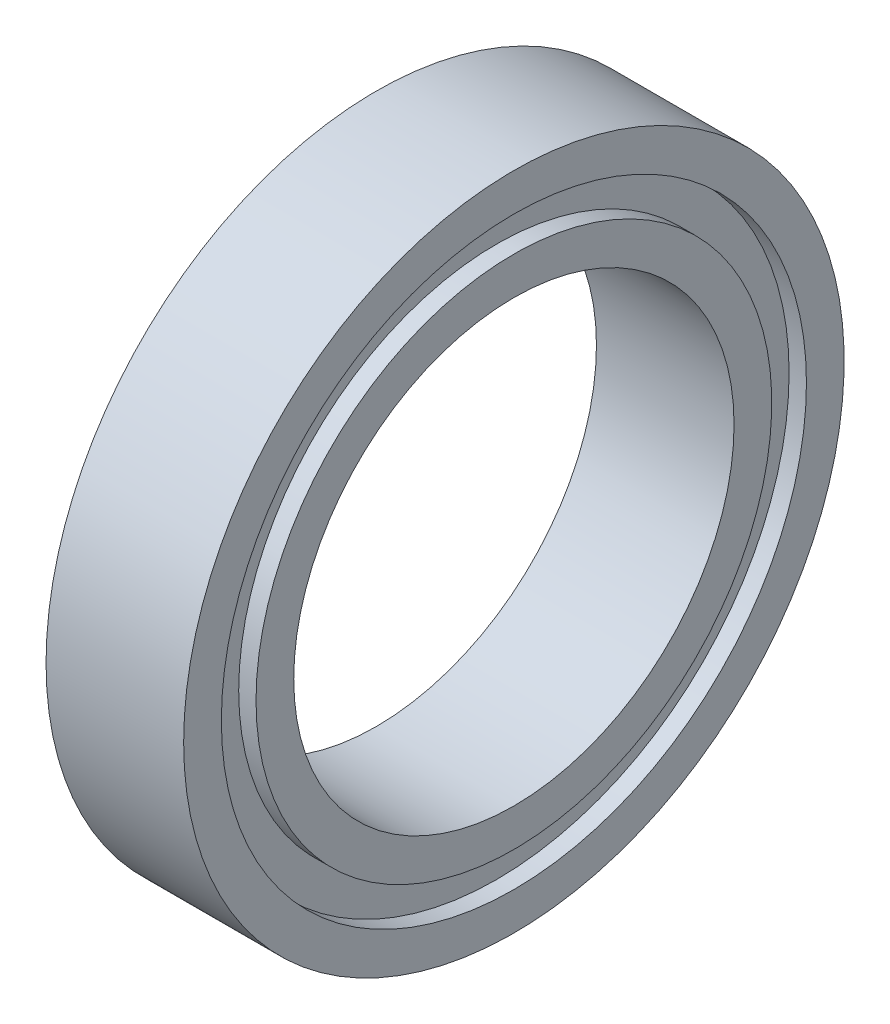
ISO-10303-21;
HEADER;
FILE_DESCRIPTION(('STEP AP214'),'2;1');
FILE_NAME('part.step','',(''),(''),'','','');
FILE_SCHEMA(('AUTOMOTIVE_DESIGN { 1 0 10303 214 1 1 1 1 }'));
ENDSEC;
DATA;
#1=APPLICATION_CONTEXT('core data for automotive mechanical design processes');
#2=APPLICATION_PROTOCOL_DEFINITION('international standard','automotive_design',2000,#1);
#3=PRODUCT_CONTEXT('',#1,'mechanical');
#4=PRODUCT('Part','Part','',(#3));
#5=PRODUCT_RELATED_PRODUCT_CATEGORY('part','',(#4));
#6=PRODUCT_DEFINITION_FORMATION('','',#4);
#7=PRODUCT_DEFINITION_CONTEXT('part definition',#1,'design');
#8=PRODUCT_DEFINITION('design','',#6,#7);
#9=PRODUCT_DEFINITION_SHAPE('','',#8);
#10=(LENGTH_UNIT() NAMED_UNIT(*) SI_UNIT(.MILLI.,.METRE.));
#11=(NAMED_UNIT(*) PLANE_ANGLE_UNIT() SI_UNIT($,.RADIAN.));
#12=(NAMED_UNIT(*) SI_UNIT($,.STERADIAN.) SOLID_ANGLE_UNIT());
#13=UNCERTAINTY_MEASURE_WITH_UNIT(LENGTH_MEASURE(1.E-05),#10,'distance_accuracy_value','');
#14=(GEOMETRIC_REPRESENTATION_CONTEXT(3) GLOBAL_UNCERTAINTY_ASSIGNED_CONTEXT((#13)) GLOBAL_UNIT_ASSIGNED_CONTEXT((#10,
#11,#12)) REPRESENTATION_CONTEXT('',''));
#15=CARTESIAN_POINT('',(0.,0.,0.));
#16=DIRECTION('',(0.,0.,1.));
#17=DIRECTION('',(1.,0.,0.));
#18=AXIS2_PLACEMENT_3D('',#15,#16,#17);
#19=CARTESIAN_POINT('',(-1.984375,9.525,0.));
#20=DIRECTION('',(1.,0.,0.));
#21=DIRECTION('',(0.,0.,-1.));
#22=AXIS2_PLACEMENT_3D('',#19,#20,#21);
#23=PLANE('',#22);
#24=CARTESIAN_POINT('',(-1.984375,0.,0.));
#25=DIRECTION('',(-1.,0.,0.));
#26=DIRECTION('',(0.,0.,1.));
#27=AXIS2_PLACEMENT_3D('',#24,#25,#26);
#28=CIRCLE('',#27,8.4375);
#29=CARTESIAN_POINT('',(-1.984375,0.,8.4375));
#30=VERTEX_POINT('',#29);
#31=EDGE_CURVE('E10',#30,#30,#28,.T.);
#32=ORIENTED_EDGE('',*,*,#31,.F.);
#33=EDGE_LOOP('',(#32));
#34=FACE_BOUND('',#33,.T.);
#35=CARTESIAN_POINT('',(-1.984375,0.,0.));
#36=DIRECTION('',(-1.,0.,0.));
#37=DIRECTION('',(0.,0.,1.));
#38=AXIS2_PLACEMENT_3D('',#35,#36,#37);
#39=CIRCLE('',#38,9.525);
#40=CARTESIAN_POINT('',(-1.984375,0.,9.525));
#41=VERTEX_POINT('',#40);
#42=EDGE_CURVE('E69',#41,#41,#39,.T.);
#43=ORIENTED_EDGE('',*,*,#42,.T.);
#44=EDGE_LOOP('',(#43));
#45=FACE_BOUND('',#44,.T.);
#46=ADVANCED_FACE('F29',(#34,#45),#23,.F.);
#47=CARTESIAN_POINT('',(-6.83914473989944,0.,0.));
#48=DIRECTION('',(-1.,0.,0.));
#49=DIRECTION('',(0.,0.,1.));
#50=AXIS2_PLACEMENT_3D('',#47,#48,#49);
#51=CYLINDRICAL_SURFACE('',#50,8.4375);
#52=CARTESIAN_POINT('',(-1.484375,0.,0.));
#53=DIRECTION('',(-1.,0.,0.));
#54=DIRECTION('',(0.,0.,1.));
#55=AXIS2_PLACEMENT_3D('',#52,#53,#54);
#56=CIRCLE('',#55,8.4375);
#57=CARTESIAN_POINT('',(-1.484375,0.,8.4375));
#58=VERTEX_POINT('',#57);
#59=EDGE_CURVE('E35',#58,#58,#56,.T.);
#60=ORIENTED_EDGE('',*,*,#59,.F.);
#61=EDGE_LOOP('',(#60));
#62=FACE_BOUND('',#61,.T.);
#63=ORIENTED_EDGE('',*,*,#31,.T.);
#64=EDGE_LOOP('',(#63));
#65=FACE_BOUND('',#64,.T.);
#66=ADVANCED_FACE('F130',(#62,#65),#51,.F.);
#67=CARTESIAN_POINT('',(-1.484375,8.4375,0.));
#68=DIRECTION('',(1.,0.,0.));
#69=DIRECTION('',(0.,0.,-1.));
#70=AXIS2_PLACEMENT_3D('',#67,#68,#69);
#71=PLANE('',#70);
#72=CARTESIAN_POINT('',(-1.484375,0.,0.));
#73=DIRECTION('',(-1.,0.,0.));
#74=DIRECTION('',(0.,0.,1.));
#75=AXIS2_PLACEMENT_3D('',#72,#73,#74);
#76=CIRCLE('',#75,7.4375);
#77=CARTESIAN_POINT('',(-1.484375,0.,7.4375));
#78=VERTEX_POINT('',#77);
#79=EDGE_CURVE('E39',#78,#78,#76,.T.);
#80=ORIENTED_EDGE('',*,*,#79,.F.);
#81=EDGE_LOOP('',(#80));
#82=FACE_BOUND('',#81,.T.);
#83=ORIENTED_EDGE('',*,*,#59,.T.);
#84=EDGE_LOOP('',(#83));
#85=FACE_BOUND('',#84,.T.);
#86=ADVANCED_FACE('F125',(#82,#85),#71,.F.);
#87=CARTESIAN_POINT('',(-6.83914473989944,0.,0.));
#88=DIRECTION('',(-1.,0.,0.));
#89=DIRECTION('',(0.,0.,1.));
#90=AXIS2_PLACEMENT_3D('',#87,#88,#89);
#91=CYLINDRICAL_SURFACE('',#90,7.4375);
#92=CARTESIAN_POINT('',(-1.984375,0.,0.));
#93=DIRECTION('',(-1.,0.,0.));
#94=DIRECTION('',(0.,0.,1.));
#95=AXIS2_PLACEMENT_3D('',#92,#93,#94);
#96=CIRCLE('',#95,7.4375);
#97=CARTESIAN_POINT('',(-1.984375,0.,7.4375));
#98=VERTEX_POINT('',#97);
#99=EDGE_CURVE('E43',#98,#98,#96,.T.);
#100=ORIENTED_EDGE('',*,*,#99,.F.);
#101=EDGE_LOOP('',(#100));
#102=FACE_BOUND('',#101,.T.);
#103=ORIENTED_EDGE('',*,*,#79,.T.);
#104=EDGE_LOOP('',(#103));
#105=FACE_BOUND('',#104,.T.);
#106=ADVANCED_FACE('F119',(#102,#105),#91,.T.);
#107=CARTESIAN_POINT('',(-1.984375,7.4375,0.));
#108=DIRECTION('',(1.,0.,0.));
#109=DIRECTION('',(0.,0.,-1.));
#110=AXIS2_PLACEMENT_3D('',#107,#108,#109);
#111=PLANE('',#110);
#112=CARTESIAN_POINT('',(-1.984375,0.,0.));
#113=DIRECTION('',(-1.,0.,0.));
#114=DIRECTION('',(0.,0.,1.));
#115=AXIS2_PLACEMENT_3D('',#112,#113,#114);
#116=CIRCLE('',#115,6.35);
#117=CARTESIAN_POINT('',(-1.984375,0.,6.35));
#118=VERTEX_POINT('',#117);
#119=EDGE_CURVE('E48',#118,#118,#116,.T.);
#120=ORIENTED_EDGE('',*,*,#119,.F.);
#121=EDGE_LOOP('',(#120));
#122=FACE_BOUND('',#121,.T.);
#123=ORIENTED_EDGE('',*,*,#99,.T.);
#124=EDGE_LOOP('',(#123));
#125=FACE_BOUND('',#124,.T.);
#126=ADVANCED_FACE('F113',(#122,#125),#111,.F.);
#127=CARTESIAN_POINT('',(-6.83914473989944,0.,0.));
#128=DIRECTION('',(-1.,0.,0.));
#129=DIRECTION('',(0.,0.,1.));
#130=AXIS2_PLACEMENT_3D('',#127,#128,#129);
#131=CYLINDRICAL_SURFACE('',#130,6.35);
#132=CARTESIAN_POINT('',(1.984375,0.,0.));
#133=DIRECTION('',(-1.,0.,0.));
#134=DIRECTION('',(0.,0.,1.));
#135=AXIS2_PLACEMENT_3D('',#132,#133,#134);
#136=CIRCLE('',#135,6.35);
#137=CARTESIAN_POINT('',(1.984375,0.,6.35));
#138=VERTEX_POINT('',#137);
#139=EDGE_CURVE('E51',#138,#138,#136,.T.);
#140=ORIENTED_EDGE('',*,*,#139,.F.);
#141=EDGE_LOOP('',(#140));
#142=FACE_BOUND('',#141,.T.);
#143=ORIENTED_EDGE('',*,*,#119,.T.);
#144=EDGE_LOOP('',(#143));
#145=FACE_BOUND('',#144,.T.);
#146=ADVANCED_FACE('F107',(#142,#145),#131,.F.);
#147=CARTESIAN_POINT('',(1.984375,7.4375,0.));
#148=DIRECTION('',(-1.,0.,0.));
#149=DIRECTION('',(0.,0.,1.));
#150=AXIS2_PLACEMENT_3D('',#147,#148,#149);
#151=PLANE('',#150);
#152=CARTESIAN_POINT('',(1.984375,0.,0.));
#153=DIRECTION('',(-1.,0.,0.));
#154=DIRECTION('',(0.,0.,1.));
#155=AXIS2_PLACEMENT_3D('',#152,#153,#154);
#156=CIRCLE('',#155,7.4375);
#157=CARTESIAN_POINT('',(1.984375,0.,7.4375));
#158=VERTEX_POINT('',#157);
#159=EDGE_CURVE('E54',#158,#158,#156,.T.);
#160=ORIENTED_EDGE('',*,*,#159,.F.);
#161=EDGE_LOOP('',(#160));
#162=FACE_BOUND('',#161,.T.);
#163=ORIENTED_EDGE('',*,*,#139,.T.);
#164=EDGE_LOOP('',(#163));
#165=FACE_BOUND('',#164,.T.);
#166=ADVANCED_FACE('F101',(#162,#165),#151,.F.);
#167=CARTESIAN_POINT('',(-6.83914473989944,0.,0.));
#168=DIRECTION('',(-1.,0.,0.));
#169=DIRECTION('',(0.,0.,1.));
#170=AXIS2_PLACEMENT_3D('',#167,#168,#169);
#171=CYLINDRICAL_SURFACE('',#170,7.4375);
#172=CARTESIAN_POINT('',(1.484375,0.,0.));
#173=DIRECTION('',(-1.,0.,0.));
#174=DIRECTION('',(0.,0.,1.));
#175=AXIS2_PLACEMENT_3D('',#172,#173,#174);
#176=CIRCLE('',#175,7.4375);
#177=CARTESIAN_POINT('',(1.484375,0.,7.4375));
#178=VERTEX_POINT('',#177);
#179=EDGE_CURVE('E57',#178,#178,#176,.T.);
#180=ORIENTED_EDGE('',*,*,#179,.F.);
#181=EDGE_LOOP('',(#180));
#182=FACE_BOUND('',#181,.T.);
#183=ORIENTED_EDGE('',*,*,#159,.T.);
#184=EDGE_LOOP('',(#183));
#185=FACE_BOUND('',#184,.T.);
#186=ADVANCED_FACE('F95',(#182,#185),#171,.T.);
#187=CARTESIAN_POINT('',(1.484375,8.4375,0.));
#188=DIRECTION('',(-1.,0.,0.));
#189=DIRECTION('',(0.,0.,1.));
#190=AXIS2_PLACEMENT_3D('',#187,#188,#189);
#191=PLANE('',#190);
#192=CARTESIAN_POINT('',(1.484375,0.,0.));
#193=DIRECTION('',(-1.,0.,0.));
#194=DIRECTION('',(0.,0.,1.));
#195=AXIS2_PLACEMENT_3D('',#192,#193,#194);
#196=CIRCLE('',#195,8.4375);
#197=CARTESIAN_POINT('',(1.484375,0.,8.4375));
#198=VERTEX_POINT('',#197);
#199=EDGE_CURVE('E60',#198,#198,#196,.T.);
#200=ORIENTED_EDGE('',*,*,#199,.F.);
#201=EDGE_LOOP('',(#200));
#202=FACE_BOUND('',#201,.T.);
#203=ORIENTED_EDGE('',*,*,#179,.T.);
#204=EDGE_LOOP('',(#203));
#205=FACE_BOUND('',#204,.T.);
#206=ADVANCED_FACE('F89',(#202,#205),#191,.F.);
#207=CARTESIAN_POINT('',(-6.83914473989944,0.,0.));
#208=DIRECTION('',(-1.,0.,0.));
#209=DIRECTION('',(0.,0.,1.));
#210=AXIS2_PLACEMENT_3D('',#207,#208,#209);
#211=CYLINDRICAL_SURFACE('',#210,8.4375);
#212=CARTESIAN_POINT('',(1.984375,0.,0.));
#213=DIRECTION('',(-1.,0.,0.));
#214=DIRECTION('',(0.,0.,1.));
#215=AXIS2_PLACEMENT_3D('',#212,#213,#214);
#216=CIRCLE('',#215,8.4375);
#217=CARTESIAN_POINT('',(1.984375,0.,8.4375));
#218=VERTEX_POINT('',#217);
#219=EDGE_CURVE('E63',#218,#218,#216,.T.);
#220=ORIENTED_EDGE('',*,*,#219,.F.);
#221=EDGE_LOOP('',(#220));
#222=FACE_BOUND('',#221,.T.);
#223=ORIENTED_EDGE('',*,*,#199,.T.);
#224=EDGE_LOOP('',(#223));
#225=FACE_BOUND('',#224,.T.);
#226=ADVANCED_FACE('F83',(#222,#225),#211,.F.);
#227=CARTESIAN_POINT('',(1.984375,9.525,0.));
#228=DIRECTION('',(-1.,0.,0.));
#229=DIRECTION('',(0.,0.,1.));
#230=AXIS2_PLACEMENT_3D('',#227,#228,#229);
#231=PLANE('',#230);
#232=CARTESIAN_POINT('',(1.984375,0.,0.));
#233=DIRECTION('',(-1.,0.,0.));
#234=DIRECTION('',(0.,0.,1.));
#235=AXIS2_PLACEMENT_3D('',#232,#233,#234);
#236=CIRCLE('',#235,9.525);
#237=CARTESIAN_POINT('',(1.984375,0.,9.525));
#238=VERTEX_POINT('',#237);
#239=EDGE_CURVE('E66',#238,#238,#236,.T.);
#240=ORIENTED_EDGE('',*,*,#239,.F.);
#241=EDGE_LOOP('',(#240));
#242=FACE_BOUND('',#241,.T.);
#243=ORIENTED_EDGE('',*,*,#219,.T.);
#244=EDGE_LOOP('',(#243));
#245=FACE_BOUND('',#244,.T.);
#246=ADVANCED_FACE('F77',(#242,#245),#231,.F.);
#247=CARTESIAN_POINT('',(-6.83914473989944,0.,0.));
#248=DIRECTION('',(-1.,0.,0.));
#249=DIRECTION('',(0.,0.,1.));
#250=AXIS2_PLACEMENT_3D('',#247,#248,#249);
#251=CYLINDRICAL_SURFACE('',#250,9.525);
#252=ORIENTED_EDGE('',*,*,#42,.F.);
#253=EDGE_LOOP('',(#252));
#254=FACE_BOUND('',#253,.T.);
#255=ORIENTED_EDGE('',*,*,#239,.T.);
#256=EDGE_LOOP('',(#255));
#257=FACE_BOUND('',#256,.T.);
#258=ADVANCED_FACE('F74',(#254,#257),#251,.T.);
#259=CLOSED_SHELL('',(#46,#66,#86,#106,#126,#146,#166,#186,#206,#226,#246,#258));
#260=MANIFOLD_SOLID_BREP('B2',#259);
#261=ADVANCED_BREP_SHAPE_REPRESENTATION('',(#18,#260),#14);
#262=SHAPE_DEFINITION_REPRESENTATION(#9,#261);
ENDSEC;
END-ISO-10303-21;
